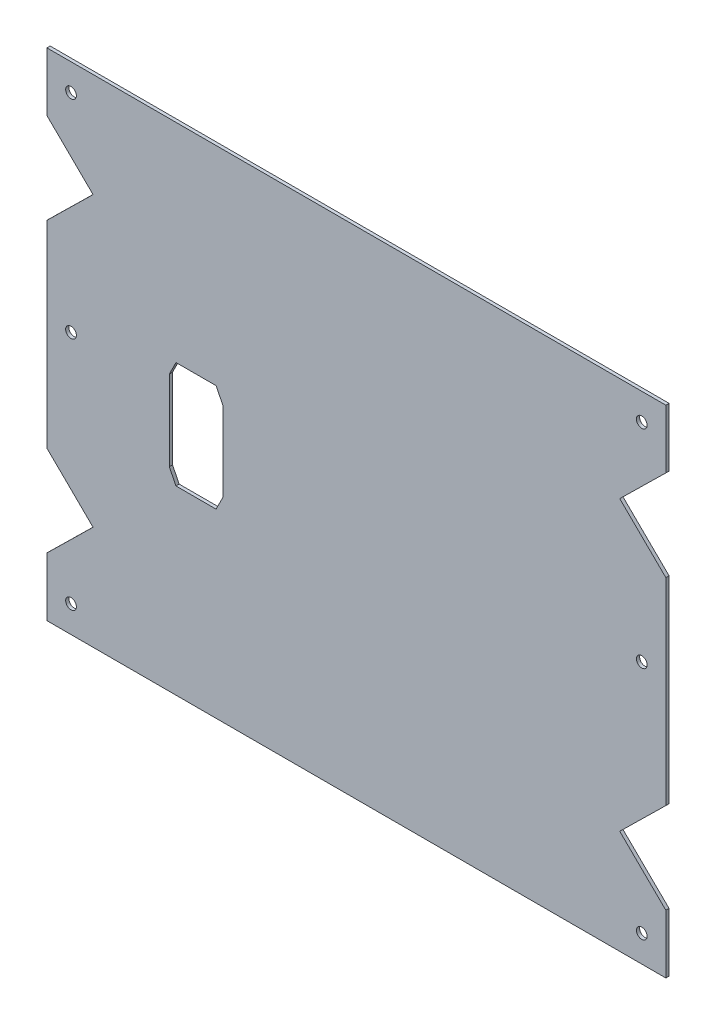
ISO-10303-21;
HEADER;
FILE_DESCRIPTION(('STEP AP214'),'2;1');
FILE_NAME('part.step','',(''),(''),'','','');
FILE_SCHEMA(('AUTOMOTIVE_DESIGN { 1 0 10303 214 1 1 1 1 }'));
ENDSEC;
DATA;
#1=APPLICATION_CONTEXT('core data for automotive mechanical design processes');
#2=APPLICATION_PROTOCOL_DEFINITION('international standard','automotive_design',2000,#1);
#3=PRODUCT_CONTEXT('',#1,'mechanical');
#4=PRODUCT('Part','Part','',(#3));
#5=PRODUCT_RELATED_PRODUCT_CATEGORY('part','',(#4));
#6=PRODUCT_DEFINITION_FORMATION('','',#4);
#7=PRODUCT_DEFINITION_CONTEXT('part definition',#1,'design');
#8=PRODUCT_DEFINITION('design','',#6,#7);
#9=PRODUCT_DEFINITION_SHAPE('','',#8);
#10=(LENGTH_UNIT() NAMED_UNIT(*) SI_UNIT(.MILLI.,.METRE.));
#11=(NAMED_UNIT(*) PLANE_ANGLE_UNIT() SI_UNIT($,.RADIAN.));
#12=(NAMED_UNIT(*) SI_UNIT($,.STERADIAN.) SOLID_ANGLE_UNIT());
#13=UNCERTAINTY_MEASURE_WITH_UNIT(LENGTH_MEASURE(1.E-05),#10,'distance_accuracy_value','');
#14=(GEOMETRIC_REPRESENTATION_CONTEXT(3) GLOBAL_UNCERTAINTY_ASSIGNED_CONTEXT((#13)) GLOBAL_UNIT_ASSIGNED_CONTEXT((#10,
#11,#12)) REPRESENTATION_CONTEXT('',''));
#15=CARTESIAN_POINT('',(0.,0.,0.));
#16=DIRECTION('',(0.,0.,1.));
#17=DIRECTION('',(1.,0.,0.));
#18=AXIS2_PLACEMENT_3D('',#15,#16,#17);
#19=CARTESIAN_POINT('',(0.,0.,-1.2));
#20=DIRECTION('',(0.,0.,1.));
#21=DIRECTION('',(1.,0.,0.));
#22=AXIS2_PLACEMENT_3D('',#19,#20,#21);
#23=PLANE('',#22);
#24=DIRECTION('',(0.71325044915418,0.700909264299852,0.));
#25=VECTOR('',#24,1.);
#26=CARTESIAN_POINT('',(-125.084094973147,27.7909727460474,-1.19999999999985));
#27=LINE('',#26,#25);
#28=CARTESIAN_POINT('',(-115.773982116284,36.9399951697851,-1.19999999999991));
#29=VERTEX_POINT('',#28);
#30=CARTESIAN_POINT('',(-98.5234627656782,53.8920333229499,-1.20000000000004));
#31=VERTEX_POINT('',#30);
#32=EDGE_CURVE('E723',#29,#31,#27,.T.);
#33=ORIENTED_EDGE('',*,*,#32,.T.);
#34=DIRECTION('',(-0.71325044915418,0.700909264299853,0.));
#35=VECTOR('',#34,1.);
#36=CARTESIAN_POINT('',(-125.084094973147,79.9930938998523,-1.19999999999968));
#37=LINE('',#36,#35);
#38=CARTESIAN_POINT('',(-115.773982116284,70.8440714761147,-1.19999999999981));
#39=VERTEX_POINT('',#38);
#40=EDGE_CURVE('E753',#31,#39,#37,.T.);
#41=ORIENTED_EDGE('',*,*,#40,.T.);
#42=DIRECTION('',(0.,1.,0.));
#43=VECTOR('',#42,1.);
#44=CARTESIAN_POINT('',(-115.773982116284,54.9669467026682,-1.1999999999999));
#45=LINE('',#44,#43);
#46=CARTESIAN_POINT('',(-115.773982116284,92.8050127238137,-1.19999999999968));
#47=VERTEX_POINT('',#46);
#48=EDGE_CURVE('E759',#47,#39,#45,.F.);
#49=ORIENTED_EDGE('',*,*,#48,.F.);
#50=DIRECTION('',(1.,0.,0.));
#51=VECTOR('',#50,1.);
#52=CARTESIAN_POINT('',(-115.773982116284,92.8050127238137,-1.19999999999968));
#53=LINE('',#52,#51);
#54=CARTESIAN_POINT('',(115.773982116284,92.8050127238136,-1.19999999999959));
#55=VERTEX_POINT('',#54);
#56=EDGE_CURVE('E778',#55,#47,#53,.F.);
#57=ORIENTED_EDGE('',*,*,#56,.F.);
#58=DIRECTION('',(0.,-1.,0.));
#59=VECTOR('',#58,1.);
#60=CARTESIAN_POINT('',(115.773982116284,92.8050127238136,-1.19999999999959));
#61=LINE('',#60,#59);
#62=CARTESIAN_POINT('',(115.773982116284,70.8440714761146,-1.19999999999981));
#63=VERTEX_POINT('',#62);
#64=EDGE_CURVE('E772',#63,#55,#61,.F.);
#65=ORIENTED_EDGE('',*,*,#64,.F.);
#66=DIRECTION('',(-0.713250449154182,-0.700909264299851,0.));
#67=VECTOR('',#66,1.);
#68=CARTESIAN_POINT('',(125.084094973147,79.9930938998522,-1.19999999999965));
#69=LINE('',#68,#67);
#70=CARTESIAN_POINT('',(98.5234627656781,53.8920333229499,-1.20000000000008));
#71=VERTEX_POINT('',#70);
#72=EDGE_CURVE('E751',#63,#71,#69,.T.);
#73=ORIENTED_EDGE('',*,*,#72,.T.);
#74=DIRECTION('',(0.713250449154181,-0.700909264299852,0.));
#75=VECTOR('',#74,1.);
#76=CARTESIAN_POINT('',(125.084094973147,27.7909727460474,-1.19999999999985));
#77=LINE('',#76,#75);
#78=CARTESIAN_POINT('',(115.773982116284,36.9399951697851,-1.19999999999991));
#79=VERTEX_POINT('',#78);
#80=EDGE_CURVE('E864',#71,#79,#77,.T.);
#81=ORIENTED_EDGE('',*,*,#80,.T.);
#82=DIRECTION('',(0.,-1.,0.));
#83=VECTOR('',#82,1.);
#84=CARTESIAN_POINT('',(115.773982116284,52.8171199432316,-1.19999999999991));
#85=LINE('',#84,#83);
#86=CARTESIAN_POINT('',(115.773982116284,-36.9399951697851,-1.1999999999999));
#87=VERTEX_POINT('',#86);
#88=EDGE_CURVE('E831',#87,#79,#85,.F.);
#89=ORIENTED_EDGE('',*,*,#88,.F.);
#90=DIRECTION('',(-0.71325044915418,-0.700909264299852,0.));
#91=VECTOR('',#90,1.);
#92=CARTESIAN_POINT('',(125.084094973147,-27.7909727460474,-1.19999999999984));
#93=LINE('',#92,#91);
#94=CARTESIAN_POINT('',(98.5234627656782,-53.8920333229499,-1.20000000000002));
#95=VERTEX_POINT('',#94);
#96=EDGE_CURVE('E862',#87,#95,#93,.T.);
#97=ORIENTED_EDGE('',*,*,#96,.T.);
#98=DIRECTION('',(0.71325044915418,-0.700909264299853,0.));
#99=VECTOR('',#98,1.);
#100=CARTESIAN_POINT('',(125.084094973147,-79.9930938998523,-1.19999999999968));
#101=LINE('',#100,#99);
#102=CARTESIAN_POINT('',(115.773982116284,-70.8440714761147,-1.19999999999981));
#103=VERTEX_POINT('',#102);
#104=EDGE_CURVE('E793',#95,#103,#101,.T.);
#105=ORIENTED_EDGE('',*,*,#104,.T.);
#106=DIRECTION('',(0.,-1.,0.));
#107=VECTOR('',#106,1.);
#108=CARTESIAN_POINT('',(115.773982116284,-54.9669467026682,-1.1999999999999));
#109=LINE('',#108,#107);
#110=CARTESIAN_POINT('',(115.773982116284,-92.8050127238137,-1.19999999999968));
#111=VERTEX_POINT('',#110);
#112=EDGE_CURVE('E804',#111,#103,#109,.F.);
#113=ORIENTED_EDGE('',*,*,#112,.F.);
#114=DIRECTION('',(-1.,0.,0.));
#115=VECTOR('',#114,1.);
#116=CARTESIAN_POINT('',(-98.9739821162841,-92.8050127238137,-1.19999999999972));
#117=LINE('',#116,#115);
#118=CARTESIAN_POINT('',(-115.773982116284,-92.8050127238137,-1.19999999999962));
#119=VERTEX_POINT('',#118);
#120=EDGE_CURVE('E819',#119,#111,#117,.F.);
#121=ORIENTED_EDGE('',*,*,#120,.F.);
#122=DIRECTION('',(0.,1.,0.));
#123=VECTOR('',#122,1.);
#124=CARTESIAN_POINT('',(-115.773982116284,-92.8050127238137,-1.19999999999962));
#125=LINE('',#124,#123);
#126=CARTESIAN_POINT('',(-115.773982116284,-70.8440714761147,-1.19999999999975));
#127=VERTEX_POINT('',#126);
#128=EDGE_CURVE('E814',#127,#119,#125,.F.);
#129=ORIENTED_EDGE('',*,*,#128,.F.);
#130=DIRECTION('',(0.71325044915418,0.700909264299853,0.));
#131=VECTOR('',#130,1.);
#132=CARTESIAN_POINT('',(-125.084094973147,-79.9930938998523,-1.19999999999962));
#133=LINE('',#132,#131);
#134=CARTESIAN_POINT('',(-98.5234627656781,-53.8920333229499,-1.19999999999997));
#135=VERTEX_POINT('',#134);
#136=EDGE_CURVE('E796',#127,#135,#133,.T.);
#137=ORIENTED_EDGE('',*,*,#136,.T.);
#138=DIRECTION('',(-0.71325044915418,0.700909264299852,0.));
#139=VECTOR('',#138,1.);
#140=CARTESIAN_POINT('',(-125.084094973147,-27.7909727460474,-1.19999999999987));
#141=LINE('',#140,#139);
#142=CARTESIAN_POINT('',(-115.773982116284,-36.9399951697851,-1.19999999999992));
#143=VERTEX_POINT('',#142);
#144=EDGE_CURVE('E728',#135,#143,#141,.T.);
#145=ORIENTED_EDGE('',*,*,#144,.T.);
#146=DIRECTION('',(0.,1.,0.));
#147=VECTOR('',#146,1.);
#148=CARTESIAN_POINT('',(-115.773982116284,-52.8171199432316,-1.19999999999992));
#149=LINE('',#148,#147);
#150=EDGE_CURVE('E790',#29,#143,#149,.F.);
#151=ORIENTED_EDGE('',*,*,#150,.F.);
#152=EDGE_LOOP('',(#33,#41,#49,#57,#65,#73,#81,#89,#97,#105,#113,#121,#129,#137,#145,#151));
#153=FACE_BOUND('',#152,.T.);
#154=DIRECTION('',(-0.447213595499958,-0.894427190999916,0.));
#155=VECTOR('',#154,1.);
#156=CARTESIAN_POINT('',(-70.,9.98321512742431,-1.2));
#157=LINE('',#156,#155);
#158=CARTESIAN_POINT('',(-67.5,14.9832151274243,-1.2));
#159=VERTEX_POINT('',#158);
#160=CARTESIAN_POINT('',(-70.,9.98321512742431,-1.2));
#161=VERTEX_POINT('',#160);
#162=EDGE_CURVE('E892',#159,#161,#157,.T.);
#163=ORIENTED_EDGE('',*,*,#162,.T.);
#164=DIRECTION('',(0.,-1.,0.));
#165=VECTOR('',#164,1.);
#166=CARTESIAN_POINT('',(-70.,-20.0167848725757,-1.2));
#167=LINE('',#166,#165);
#168=CARTESIAN_POINT('',(-70.,-20.0167848725757,-1.2));
#169=VERTEX_POINT('',#168);
#170=EDGE_CURVE('E872',#161,#169,#167,.T.);
#171=ORIENTED_EDGE('',*,*,#170,.T.);
#172=DIRECTION('',(0.447213595499958,-0.894427190999916,0.));
#173=VECTOR('',#172,1.);
#174=CARTESIAN_POINT('',(-67.5,-25.0167848725757,-1.2));
#175=LINE('',#174,#173);
#176=CARTESIAN_POINT('',(-67.5,-25.0167848725757,-1.2));
#177=VERTEX_POINT('',#176);
#178=EDGE_CURVE('E875',#169,#177,#175,.T.);
#179=ORIENTED_EDGE('',*,*,#178,.T.);
#180=DIRECTION('',(1.,0.,0.));
#181=VECTOR('',#180,1.);
#182=CARTESIAN_POINT('',(-52.5,-25.0167848725757,-1.2));
#183=LINE('',#182,#181);
#184=CARTESIAN_POINT('',(-52.5,-25.0167848725757,-1.2));
#185=VERTEX_POINT('',#184);
#186=EDGE_CURVE('E558',#177,#185,#183,.T.);
#187=ORIENTED_EDGE('',*,*,#186,.T.);
#188=DIRECTION('',(0.447213595499959,0.894427190999915,0.));
#189=VECTOR('',#188,1.);
#190=CARTESIAN_POINT('',(-50.,-20.0167848725757,-1.2));
#191=LINE('',#190,#189);
#192=CARTESIAN_POINT('',(-50.,-20.0167848725757,-1.2));
#193=VERTEX_POINT('',#192);
#194=EDGE_CURVE('E880',#185,#193,#191,.T.);
#195=ORIENTED_EDGE('',*,*,#194,.T.);
#196=DIRECTION('',(0.,1.,0.));
#197=VECTOR('',#196,1.);
#198=CARTESIAN_POINT('',(-50.,9.98321512742431,-1.2));
#199=LINE('',#198,#197);
#200=CARTESIAN_POINT('',(-50.,9.98321512742431,-1.2));
#201=VERTEX_POINT('',#200);
#202=EDGE_CURVE('E883',#193,#201,#199,.T.);
#203=ORIENTED_EDGE('',*,*,#202,.T.);
#204=DIRECTION('',(-0.447213595499958,0.894427190999916,0.));
#205=VECTOR('',#204,1.);
#206=CARTESIAN_POINT('',(-52.5,14.9832151274243,-1.2));
#207=LINE('',#206,#205);
#208=CARTESIAN_POINT('',(-52.5,14.9832151274243,-1.2));
#209=VERTEX_POINT('',#208);
#210=EDGE_CURVE('E886',#201,#209,#207,.T.);
#211=ORIENTED_EDGE('',*,*,#210,.T.);
#212=DIRECTION('',(-1.,0.,0.));
#213=VECTOR('',#212,1.);
#214=CARTESIAN_POINT('',(-67.5,14.9832151274243,-1.2));
#215=LINE('',#214,#213);
#216=EDGE_CURVE('E889',#209,#159,#215,.T.);
#217=ORIENTED_EDGE('',*,*,#216,.T.);
#218=EDGE_LOOP('',(#163,#171,#179,#187,#195,#203,#211,#217));
#219=FACE_BOUND('',#218,.T.);
#220=CARTESIAN_POINT('',(106.773982116284,5.12853310424553,-1.19999999999998));
#221=DIRECTION('',(0.,0.,-1.));
#222=DIRECTION('',(-1.,0.,0.));
#223=AXIS2_PLACEMENT_3D('',#220,#221,#222);
#224=CIRCLE('',#223,2.);
#225=CARTESIAN_POINT('',(104.773982116284,5.12853310424553,-1.19999999999999));
#226=VERTEX_POINT('',#225);
#227=EDGE_CURVE('E867',#226,#226,#224,.T.);
#228=ORIENTED_EDGE('',*,*,#227,.F.);
#229=EDGE_LOOP('',(#228));
#230=FACE_BOUND('',#229,.T.);
#231=CARTESIAN_POINT('',(-106.773982116284,5.12853310424474,-1.19999999999998));
#232=DIRECTION('',(0.,0.,-1.));
#233=DIRECTION('',(-1.,0.,0.));
#234=AXIS2_PLACEMENT_3D('',#231,#232,#233);
#235=CIRCLE('',#234,2.);
#236=CARTESIAN_POINT('',(-108.773982116284,5.12853310424474,-1.19999999999997));
#237=VERTEX_POINT('',#236);
#238=EDGE_CURVE('E842',#237,#237,#235,.T.);
#239=ORIENTED_EDGE('',*,*,#238,.F.);
#240=EDGE_LOOP('',(#239));
#241=FACE_BOUND('',#240,.T.);
#242=CARTESIAN_POINT('',(106.773982116285,-82.8050127238138,-1.1999999999998));
#243=DIRECTION('',(0.,0.,-1.));
#244=DIRECTION('',(-0.999847695156391,-0.0174524064372864,0.));
#245=AXIS2_PLACEMENT_3D('',#242,#243,#244);
#246=CIRCLE('',#245,2.);
#247=CARTESIAN_POINT('',(104.774286725972,-82.8399175366883,-1.19999999999981));
#248=VERTEX_POINT('',#247);
#249=EDGE_CURVE('E816',#248,#248,#246,.T.);
#250=ORIENTED_EDGE('',*,*,#249,.F.);
#251=EDGE_LOOP('',(#250));
#252=FACE_BOUND('',#251,.T.);
#253=CARTESIAN_POINT('',(-106.773982116284,-82.8050127238137,-1.19999999999974));
#254=DIRECTION('',(0.,0.,-1.));
#255=DIRECTION('',(-0.999847695156391,0.0174524064372864,0.));
#256=AXIS2_PLACEMENT_3D('',#253,#254,#255);
#257=CIRCLE('',#256,2.);
#258=CARTESIAN_POINT('',(-108.773677506597,-82.7701079109391,-1.19999999999972));
#259=VERTEX_POINT('',#258);
#260=EDGE_CURVE('E743',#259,#259,#257,.T.);
#261=ORIENTED_EDGE('',*,*,#260,.F.);
#262=EDGE_LOOP('',(#261));
#263=FACE_BOUND('',#262,.T.);
#264=CARTESIAN_POINT('',(106.773982116283,82.8050127238138,-1.19999999999974));
#265=DIRECTION('',(0.,0.,-1.));
#266=DIRECTION('',(0.999847695156391,-0.0174524064372899,0.));
#267=AXIS2_PLACEMENT_3D('',#264,#265,#266);
#268=CIRCLE('',#267,2.);
#269=CARTESIAN_POINT('',(108.773677506596,82.7701079109392,-1.19999999999972));
#270=VERTEX_POINT('',#269);
#271=EDGE_CURVE('E780',#270,#270,#268,.T.);
#272=ORIENTED_EDGE('',*,*,#271,.F.);
#273=EDGE_LOOP('',(#272));
#274=FACE_BOUND('',#273,.T.);
#275=CARTESIAN_POINT('',(-106.773982116284,82.8050127238137,-1.19999999999983));
#276=DIRECTION('',(0.,0.,-1.));
#277=DIRECTION('',(0.999847695156391,0.0174524064372864,0.));
#278=AXIS2_PLACEMENT_3D('',#275,#276,#277);
#279=CIRCLE('',#278,2.);
#280=CARTESIAN_POINT('',(-104.774286725971,82.8399175366883,-1.19999999999984));
#281=VERTEX_POINT('',#280);
#282=EDGE_CURVE('E740',#281,#281,#279,.T.);
#283=ORIENTED_EDGE('',*,*,#282,.F.);
#284=EDGE_LOOP('',(#283));
#285=FACE_BOUND('',#284,.T.);
#286=ADVANCED_FACE('F541',(#153,#219,#230,#241,#252,#263,#274,#285),#23,.F.);
#287=CARTESIAN_POINT('',(0.,0.,0.));
#288=DIRECTION('',(0.,0.,1.));
#289=DIRECTION('',(1.,0.,0.));
#290=AXIS2_PLACEMENT_3D('',#287,#288,#289);
#291=PLANE('',#290);
#292=DIRECTION('',(-0.71325044915418,0.700909264299853,0.));
#293=VECTOR('',#292,1.);
#294=CARTESIAN_POINT('',(-99.9739821162841,55.3174547188867,0.));
#295=LINE('',#294,#293);
#296=CARTESIAN_POINT('',(-98.5234627656782,53.8920333229499,0.));
#297=VERTEX_POINT('',#296);
#298=CARTESIAN_POINT('',(-115.773982116284,70.8440714761147,1.94289029309402E-13));
#299=VERTEX_POINT('',#298);
#300=EDGE_CURVE('E744',#297,#299,#295,.T.);
#301=ORIENTED_EDGE('',*,*,#300,.F.);
#302=DIRECTION('',(0.71325044915418,0.700909264299852,0.));
#303=VECTOR('',#302,1.);
#304=CARTESIAN_POINT('',(-175.666159857671,-21.9158839787141,4.44089209850063E-13));
#305=LINE('',#304,#303);
#306=CARTESIAN_POINT('',(-115.773982116284,36.9399951697851,0.));
#307=VERTEX_POINT('',#306);
#308=EDGE_CURVE('E829',#307,#297,#305,.T.);
#309=ORIENTED_EDGE('',*,*,#308,.F.);
#310=DIRECTION('',(0.,-1.,0.));
#311=VECTOR('',#310,1.);
#312=CARTESIAN_POINT('',(-115.773982116284,0.,0.));
#313=LINE('',#312,#311);
#314=CARTESIAN_POINT('',(-115.773982116284,-36.9399951697851,0.));
#315=VERTEX_POINT('',#314);
#316=EDGE_CURVE('E719',#307,#315,#313,.T.);
#317=ORIENTED_EDGE('',*,*,#316,.T.);
#318=DIRECTION('',(-0.71325044915418,0.700909264299852,0.));
#319=VECTOR('',#318,1.);
#320=CARTESIAN_POINT('',(-99.9739821162841,-52.4666119270131,0.));
#321=LINE('',#320,#319);
#322=CARTESIAN_POINT('',(-98.5234627656781,-53.8920333229499,0.));
#323=VERTEX_POINT('',#322);
#324=EDGE_CURVE('E715',#323,#315,#321,.T.);
#325=ORIENTED_EDGE('',*,*,#324,.F.);
#326=DIRECTION('',(0.71325044915418,0.700909264299853,0.));
#327=VECTOR('',#326,1.);
#328=CARTESIAN_POINT('',(-129.362490259407,-84.1974612381873,4.23272528138341E-13));
#329=LINE('',#328,#327);
#330=CARTESIAN_POINT('',(-115.773982116284,-70.8440714761147,2.56739074444567E-13));
#331=VERTEX_POINT('',#330);
#332=EDGE_CURVE('E703',#331,#323,#329,.T.);
#333=ORIENTED_EDGE('',*,*,#332,.F.);
#334=DIRECTION('',(0.,-1.,0.));
#335=VECTOR('',#334,1.);
#336=CARTESIAN_POINT('',(-115.773982116284,-51.8454959292279,1.31838984174237E-13));
#337=LINE('',#336,#335);
#338=CARTESIAN_POINT('',(-115.773982116284,-92.8050127238137,3.88578058618805E-13));
#339=VERTEX_POINT('',#338);
#340=EDGE_CURVE('E812',#331,#339,#337,.T.);
#341=ORIENTED_EDGE('',*,*,#340,.T.);
#342=DIRECTION('',(1.,0.,0.));
#343=VECTOR('',#342,1.);
#344=CARTESIAN_POINT('',(-152.744662462161,-92.8050127238137,6.52256026967279E-13));
#345=LINE('',#344,#343);
#346=CARTESIAN_POINT('',(115.773982116284,-92.8050127238137,3.2612801348364E-13));
#347=VERTEX_POINT('',#346);
#348=EDGE_CURVE('E810',#339,#347,#345,.T.);
#349=ORIENTED_EDGE('',*,*,#348,.T.);
#350=DIRECTION('',(0.,1.,0.));
#351=VECTOR('',#350,1.);
#352=CARTESIAN_POINT('',(115.773982116284,-51.8454959292279,0.));
#353=LINE('',#352,#351);
#354=CARTESIAN_POINT('',(115.773982116284,-70.8440714761147,1.94289029309402E-13));
#355=VERTEX_POINT('',#354);
#356=EDGE_CURVE('E798',#347,#355,#353,.T.);
#357=ORIENTED_EDGE('',*,*,#356,.T.);
#358=DIRECTION('',(0.71325044915418,-0.700909264299853,0.));
#359=VECTOR('',#358,1.);
#360=CARTESIAN_POINT('',(99.9739821162842,-55.3174547188867,0.));
#361=LINE('',#360,#359);
#362=CARTESIAN_POINT('',(98.5234627656782,-53.8920333229499,0.));
#363=VERTEX_POINT('',#362);
#364=EDGE_CURVE('E712',#363,#355,#361,.T.);
#365=ORIENTED_EDGE('',*,*,#364,.F.);
#366=DIRECTION('',(-0.71325044915418,-0.700909264299852,0.));
#367=VECTOR('',#366,1.);
#368=CARTESIAN_POINT('',(175.666159857671,21.9158839787142,4.57966997657877E-13));
#369=LINE('',#368,#367);
#370=CARTESIAN_POINT('',(115.773982116284,-36.9399951697851,0.));
#371=VERTEX_POINT('',#370);
#372=EDGE_CURVE('E847',#371,#363,#369,.T.);
#373=ORIENTED_EDGE('',*,*,#372,.F.);
#374=DIRECTION('',(0.,1.,0.));
#375=VECTOR('',#374,1.);
#376=CARTESIAN_POINT('',(115.773982116284,0.,0.));
#377=LINE('',#376,#375);
#378=CARTESIAN_POINT('',(115.773982116284,36.9399951697851,0.));
#379=VERTEX_POINT('',#378);
#380=EDGE_CURVE('E852',#371,#379,#377,.T.);
#381=ORIENTED_EDGE('',*,*,#380,.T.);
#382=DIRECTION('',(0.713250449154181,-0.700909264299852,0.));
#383=VECTOR('',#382,1.);
#384=CARTESIAN_POINT('',(99.9739821162841,52.4666119270131,0.));
#385=LINE('',#384,#383);
#386=CARTESIAN_POINT('',(98.5234627656781,53.8920333229499,0.));
#387=VERTEX_POINT('',#386);
#388=EDGE_CURVE('E860',#387,#379,#385,.T.);
#389=ORIENTED_EDGE('',*,*,#388,.F.);
#390=DIRECTION('',(-0.713250449154182,-0.700909264299851,0.));
#391=VECTOR('',#390,1.);
#392=CARTESIAN_POINT('',(129.362490259407,84.1974612381872,4.30211422042248E-13));
#393=LINE('',#392,#391);
#394=CARTESIAN_POINT('',(115.773982116284,70.8440714761146,2.0122792321331E-13));
#395=VERTEX_POINT('',#394);
#396=EDGE_CURVE('E746',#395,#387,#393,.T.);
#397=ORIENTED_EDGE('',*,*,#396,.F.);
#398=DIRECTION('',(0.,1.,0.));
#399=VECTOR('',#398,1.);
#400=CARTESIAN_POINT('',(115.773982116284,51.8454959292278,0.));
#401=LINE('',#400,#399);
#402=CARTESIAN_POINT('',(115.773982116284,92.8050127238136,4.16333634234434E-13));
#403=VERTEX_POINT('',#402);
#404=EDGE_CURVE('E767',#395,#403,#401,.T.);
#405=ORIENTED_EDGE('',*,*,#404,.T.);
#406=DIRECTION('',(-1.,0.,0.));
#407=VECTOR('',#406,1.);
#408=CARTESIAN_POINT('',(152.744662462161,92.8050127238135,6.73072708679001E-13));
#409=LINE('',#408,#407);
#410=CARTESIAN_POINT('',(-115.773982116284,92.8050127238137,3.2612801348364E-13));
#411=VERTEX_POINT('',#410);
#412=EDGE_CURVE('E765',#403,#411,#409,.T.);
#413=ORIENTED_EDGE('',*,*,#412,.T.);
#414=DIRECTION('',(0.,-1.,0.));
#415=VECTOR('',#414,1.);
#416=CARTESIAN_POINT('',(-115.773982116284,51.8454959292279,0.));
#417=LINE('',#416,#415);
#418=EDGE_CURVE('E756',#411,#299,#417,.T.);
#419=ORIENTED_EDGE('',*,*,#418,.T.);
#420=EDGE_LOOP('',(#301,#309,#317,#325,#333,#341,#349,#357,#365,#373,#381,#389,#397,#405,#413,#419));
#421=FACE_BOUND('',#420,.T.);
#422=DIRECTION('',(0.,-1.,0.));
#423=VECTOR('',#422,1.);
#424=CARTESIAN_POINT('',(-70.,-20.0167848725757,0.));
#425=LINE('',#424,#423);
#426=CARTESIAN_POINT('',(-70.,9.98321512742431,0.));
#427=VERTEX_POINT('',#426);
#428=CARTESIAN_POINT('',(-70.,-20.0167848725757,0.));
#429=VERTEX_POINT('',#428);
#430=EDGE_CURVE('E565',#427,#429,#425,.T.);
#431=ORIENTED_EDGE('',*,*,#430,.F.);
#432=DIRECTION('',(-0.447213595499958,-0.894427190999916,0.));
#433=VECTOR('',#432,1.);
#434=CARTESIAN_POINT('',(-70.,9.98321512742431,0.));
#435=LINE('',#434,#433);
#436=CARTESIAN_POINT('',(-67.5,14.9832151274243,0.));
#437=VERTEX_POINT('',#436);
#438=EDGE_CURVE('E876',#437,#427,#435,.T.);
#439=ORIENTED_EDGE('',*,*,#438,.F.);
#440=DIRECTION('',(-1.,0.,0.));
#441=VECTOR('',#440,1.);
#442=CARTESIAN_POINT('',(-67.5,14.9832151274243,0.));
#443=LINE('',#442,#441);
#444=CARTESIAN_POINT('',(-52.5,14.9832151274243,0.));
#445=VERTEX_POINT('',#444);
#446=EDGE_CURVE('E911',#445,#437,#443,.T.);
#447=ORIENTED_EDGE('',*,*,#446,.F.);
#448=DIRECTION('',(-0.447213595499958,0.894427190999916,0.));
#449=VECTOR('',#448,1.);
#450=CARTESIAN_POINT('',(-52.5,14.9832151274243,0.));
#451=LINE('',#450,#449);
#452=CARTESIAN_POINT('',(-50.,9.98321512742431,0.));
#453=VERTEX_POINT('',#452);
#454=EDGE_CURVE('E908',#453,#445,#451,.T.);
#455=ORIENTED_EDGE('',*,*,#454,.F.);
#456=DIRECTION('',(0.,1.,0.));
#457=VECTOR('',#456,1.);
#458=CARTESIAN_POINT('',(-50.,9.98321512742431,0.));
#459=LINE('',#458,#457);
#460=CARTESIAN_POINT('',(-50.,-20.0167848725757,0.));
#461=VERTEX_POINT('',#460);
#462=EDGE_CURVE('E905',#461,#453,#459,.T.);
#463=ORIENTED_EDGE('',*,*,#462,.F.);
#464=DIRECTION('',(0.447213595499959,0.894427190999915,0.));
#465=VECTOR('',#464,1.);
#466=CARTESIAN_POINT('',(-50.,-20.0167848725757,0.));
#467=LINE('',#466,#465);
#468=CARTESIAN_POINT('',(-52.5,-25.0167848725757,0.));
#469=VERTEX_POINT('',#468);
#470=EDGE_CURVE('E902',#469,#461,#467,.T.);
#471=ORIENTED_EDGE('',*,*,#470,.F.);
#472=DIRECTION('',(1.,0.,0.));
#473=VECTOR('',#472,1.);
#474=CARTESIAN_POINT('',(-52.5,-25.0167848725757,0.));
#475=LINE('',#474,#473);
#476=CARTESIAN_POINT('',(-67.5,-25.0167848725757,0.));
#477=VERTEX_POINT('',#476);
#478=EDGE_CURVE('E899',#477,#469,#475,.T.);
#479=ORIENTED_EDGE('',*,*,#478,.F.);
#480=DIRECTION('',(0.447213595499958,-0.894427190999916,0.));
#481=VECTOR('',#480,1.);
#482=CARTESIAN_POINT('',(-67.5,-25.0167848725757,0.));
#483=LINE('',#482,#481);
#484=EDGE_CURVE('E896',#429,#477,#483,.T.);
#485=ORIENTED_EDGE('',*,*,#484,.F.);
#486=EDGE_LOOP('',(#431,#439,#447,#455,#463,#471,#479,#485));
#487=FACE_BOUND('',#486,.T.);
#488=CARTESIAN_POINT('',(106.773982116284,5.12853310424554,2.4980018054066E-13));
#489=DIRECTION('',(0.,0.,-1.));
#490=DIRECTION('',(0.,-1.,0.));
#491=AXIS2_PLACEMENT_3D('',#488,#489,#490);
#492=CIRCLE('',#491,2.);
#493=CARTESIAN_POINT('',(106.773982116284,3.12853310424553,2.57833923754589E-13));
#494=VERTEX_POINT('',#493);
#495=EDGE_CURVE('E855',#494,#494,#492,.T.);
#496=ORIENTED_EDGE('',*,*,#495,.T.);
#497=EDGE_LOOP('',(#496));
#498=FACE_BOUND('',#497,.T.);
#499=CARTESIAN_POINT('',(-106.773982116284,5.12853310424473,1.94289029309402E-13));
#500=DIRECTION('',(0.,0.,1.));
#501=DIRECTION('',(0.,-1.,0.));
#502=AXIS2_PLACEMENT_3D('',#499,#500,#501);
#503=CIRCLE('',#502,2.);
#504=CARTESIAN_POINT('',(-106.773982116284,3.12853310424473,1.86255286095474E-13));
#505=VERTEX_POINT('',#504);
#506=EDGE_CURVE('E839',#505,#505,#503,.T.);
#507=ORIENTED_EDGE('',*,*,#506,.F.);
#508=EDGE_LOOP('',(#507));
#509=FACE_BOUND('',#508,.T.);
#510=CARTESIAN_POINT('',(106.773982116285,-82.8050127238138,6.38378239159465E-13));
#511=DIRECTION('',(0.,0.,-1.));
#512=DIRECTION('',(-0.999847695156391,-0.0174524064372864,0.));
#513=AXIS2_PLACEMENT_3D('',#510,#511,#512);
#514=CIRCLE('',#513,2.);
#515=CARTESIAN_POINT('',(104.774286725972,-82.8399175366883,6.39651092509963E-13));
#516=VERTEX_POINT('',#515);
#517=EDGE_CURVE('E801',#516,#516,#514,.T.);
#518=ORIENTED_EDGE('',*,*,#517,.T.);
#519=EDGE_LOOP('',(#518));
#520=FACE_BOUND('',#519,.T.);
#521=CARTESIAN_POINT('',(-106.773982116284,-82.8050127238137,2.42861286636753E-13));
#522=DIRECTION('',(0.,0.,1.));
#523=DIRECTION('',(0.999847695156391,-0.0174524064372864,0.));
#524=AXIS2_PLACEMENT_3D('',#521,#522,#523);
#525=CIRCLE('',#524,2.);
#526=CARTESIAN_POINT('',(-104.774286725971,-82.8399175366883,2.28066697471885E-13));
#527=VERTEX_POINT('',#526);
#528=EDGE_CURVE('E824',#527,#527,#525,.T.);
#529=ORIENTED_EDGE('',*,*,#528,.F.);
#530=EDGE_LOOP('',(#529));
#531=FACE_BOUND('',#530,.T.);
#532=CARTESIAN_POINT('',(-106.773982116284,82.8050127238137,5.41233724504764E-13));
#533=DIRECTION('',(0.,0.,1.));
#534=DIRECTION('',(-0.999847695156391,-0.0174524064372864,0.));
#535=AXIS2_PLACEMENT_3D('',#532,#533,#534);
#536=CIRCLE('',#535,2.);
#537=CARTESIAN_POINT('',(-108.773677506597,82.7701079109391,5.39960871154266E-13));
#538=VERTEX_POINT('',#537);
#539=EDGE_CURVE('E783',#538,#538,#536,.T.);
#540=ORIENTED_EDGE('',*,*,#539,.F.);
#541=EDGE_LOOP('',(#540));
#542=FACE_BOUND('',#541,.T.);
#543=CARTESIAN_POINT('',(106.773982116283,82.8050127238137,3.40005801291454E-13));
#544=DIRECTION('',(0.,0.,-1.));
#545=DIRECTION('',(0.999847695156391,-0.0174524064372899,0.));
#546=AXIS2_PLACEMENT_3D('',#543,#544,#545);
#547=CIRCLE('',#546,2.);
#548=CARTESIAN_POINT('',(108.773677506596,82.7701079109392,3.54679285073656E-13));
#549=VERTEX_POINT('',#548);
#550=EDGE_CURVE('E769',#549,#549,#547,.T.);
#551=ORIENTED_EDGE('',*,*,#550,.T.);
#552=EDGE_LOOP('',(#551));
#553=FACE_BOUND('',#552,.T.);
#554=ADVANCED_FACE('F543',(#421,#487,#498,#509,#520,#531,#542,#553),#291,.T.);
#555=CARTESIAN_POINT('',(-70.,-20.0167848725757,-1.2));
#556=DIRECTION('',(-1.,0.,0.));
#557=DIRECTION('',(0.,0.,1.));
#558=AXIS2_PLACEMENT_3D('',#555,#556,#557);
#559=PLANE('',#558);
#560=ORIENTED_EDGE('',*,*,#430,.T.);
#561=DIRECTION('',(0.,0.,1.));
#562=VECTOR('',#561,1.);
#563=CARTESIAN_POINT('',(-70.,-20.0167848725757,-1.2));
#564=LINE('',#563,#562);
#565=EDGE_CURVE('E545',#169,#429,#564,.T.);
#566=ORIENTED_EDGE('',*,*,#565,.F.);
#567=ORIENTED_EDGE('',*,*,#170,.F.);
#568=DIRECTION('',(0.,0.,1.));
#569=VECTOR('',#568,1.);
#570=CARTESIAN_POINT('',(-70.,9.98321512742431,-1.2));
#571=LINE('',#570,#569);
#572=EDGE_CURVE('E13',#161,#427,#571,.T.);
#573=ORIENTED_EDGE('',*,*,#572,.T.);
#574=EDGE_LOOP('',(#560,#566,#567,#573));
#575=FACE_BOUND('',#574,.T.);
#576=ADVANCED_FACE('F943',(#575),#559,.F.);
#577=CARTESIAN_POINT('',(-70.,9.98321512742431,-1.2));
#578=DIRECTION('',(-0.894427190999916,0.447213595499958,0.));
#579=DIRECTION('',(-0.447213595499958,-0.894427190999916,0.));
#580=AXIS2_PLACEMENT_3D('',#577,#578,#579);
#581=PLANE('',#580);
#582=ORIENTED_EDGE('',*,*,#438,.T.);
#583=ORIENTED_EDGE('',*,*,#572,.F.);
#584=ORIENTED_EDGE('',*,*,#162,.F.);
#585=DIRECTION('',(0.,0.,1.));
#586=VECTOR('',#585,1.);
#587=CARTESIAN_POINT('',(-67.5,14.9832151274243,-1.2));
#588=LINE('',#587,#586);
#589=EDGE_CURVE('E550',#159,#437,#588,.T.);
#590=ORIENTED_EDGE('',*,*,#589,.T.);
#591=EDGE_LOOP('',(#582,#583,#584,#590));
#592=FACE_BOUND('',#591,.T.);
#593=ADVANCED_FACE('F945',(#592),#581,.F.);
#594=CARTESIAN_POINT('',(-67.5,14.9832151274243,-1.2));
#595=DIRECTION('',(0.,1.,0.));
#596=DIRECTION('',(0.,0.,1.));
#597=AXIS2_PLACEMENT_3D('',#594,#595,#596);
#598=PLANE('',#597);
#599=ORIENTED_EDGE('',*,*,#446,.T.);
#600=ORIENTED_EDGE('',*,*,#589,.F.);
#601=ORIENTED_EDGE('',*,*,#216,.F.);
#602=DIRECTION('',(0.,0.,1.));
#603=VECTOR('',#602,1.);
#604=CARTESIAN_POINT('',(-52.5,14.9832151274243,-1.2));
#605=LINE('',#604,#603);
#606=EDGE_CURVE('E917',#209,#445,#605,.T.);
#607=ORIENTED_EDGE('',*,*,#606,.T.);
#608=EDGE_LOOP('',(#599,#600,#601,#607));
#609=FACE_BOUND('',#608,.T.);
#610=ADVANCED_FACE('F949',(#609),#598,.F.);
#611=CARTESIAN_POINT('',(-52.5,14.9832151274243,-1.2));
#612=DIRECTION('',(0.894427190999916,0.447213595499958,0.));
#613=DIRECTION('',(-0.447213595499958,0.894427190999916,0.));
#614=AXIS2_PLACEMENT_3D('',#611,#612,#613);
#615=PLANE('',#614);
#616=ORIENTED_EDGE('',*,*,#454,.T.);
#617=ORIENTED_EDGE('',*,*,#606,.F.);
#618=ORIENTED_EDGE('',*,*,#210,.F.);
#619=DIRECTION('',(0.,0.,1.));
#620=VECTOR('',#619,1.);
#621=CARTESIAN_POINT('',(-50.,9.98321512742431,-1.2));
#622=LINE('',#621,#620);
#623=EDGE_CURVE('E919',#201,#453,#622,.T.);
#624=ORIENTED_EDGE('',*,*,#623,.T.);
#625=EDGE_LOOP('',(#616,#617,#618,#624));
#626=FACE_BOUND('',#625,.T.);
#627=ADVANCED_FACE('F953',(#626),#615,.F.);
#628=CARTESIAN_POINT('',(-50.,9.98321512742431,-1.2));
#629=DIRECTION('',(1.,0.,0.));
#630=DIRECTION('',(0.,0.,-1.));
#631=AXIS2_PLACEMENT_3D('',#628,#629,#630);
#632=PLANE('',#631);
#633=ORIENTED_EDGE('',*,*,#462,.T.);
#634=ORIENTED_EDGE('',*,*,#623,.F.);
#635=ORIENTED_EDGE('',*,*,#202,.F.);
#636=DIRECTION('',(0.,0.,1.));
#637=VECTOR('',#636,1.);
#638=CARTESIAN_POINT('',(-50.,-20.0167848725757,-1.2));
#639=LINE('',#638,#637);
#640=EDGE_CURVE('E921',#193,#461,#639,.T.);
#641=ORIENTED_EDGE('',*,*,#640,.T.);
#642=EDGE_LOOP('',(#633,#634,#635,#641));
#643=FACE_BOUND('',#642,.T.);
#644=ADVANCED_FACE('F955',(#643),#632,.F.);
#645=CARTESIAN_POINT('',(-50.,-20.0167848725757,-1.2));
#646=DIRECTION('',(0.894427190999915,-0.447213595499959,0.));
#647=DIRECTION('',(0.447213595499959,0.894427190999915,0.));
#648=AXIS2_PLACEMENT_3D('',#645,#646,#647);
#649=PLANE('',#648);
#650=ORIENTED_EDGE('',*,*,#470,.T.);
#651=ORIENTED_EDGE('',*,*,#640,.F.);
#652=ORIENTED_EDGE('',*,*,#194,.F.);
#653=DIRECTION('',(0.,0.,1.));
#654=VECTOR('',#653,1.);
#655=CARTESIAN_POINT('',(-52.5,-25.0167848725757,-1.2));
#656=LINE('',#655,#654);
#657=EDGE_CURVE('E923',#185,#469,#656,.T.);
#658=ORIENTED_EDGE('',*,*,#657,.T.);
#659=EDGE_LOOP('',(#650,#651,#652,#658));
#660=FACE_BOUND('',#659,.T.);
#661=ADVANCED_FACE('F938',(#660),#649,.F.);
#662=CARTESIAN_POINT('',(-52.5,-25.0167848725757,-1.2));
#663=DIRECTION('',(0.,-1.,0.));
#664=DIRECTION('',(0.,0.,-1.));
#665=AXIS2_PLACEMENT_3D('',#662,#663,#664);
#666=PLANE('',#665);
#667=ORIENTED_EDGE('',*,*,#478,.T.);
#668=ORIENTED_EDGE('',*,*,#657,.F.);
#669=ORIENTED_EDGE('',*,*,#186,.F.);
#670=DIRECTION('',(0.,0.,1.));
#671=VECTOR('',#670,1.);
#672=CARTESIAN_POINT('',(-67.5,-25.0167848725757,-1.2));
#673=LINE('',#672,#671);
#674=EDGE_CURVE('E924',#177,#477,#673,.T.);
#675=ORIENTED_EDGE('',*,*,#674,.T.);
#676=EDGE_LOOP('',(#667,#668,#669,#675));
#677=FACE_BOUND('',#676,.T.);
#678=ADVANCED_FACE('F935',(#677),#666,.F.);
#679=CARTESIAN_POINT('',(-67.5,-25.0167848725757,-1.2));
#680=DIRECTION('',(-0.894427190999916,-0.447213595499958,0.));
#681=DIRECTION('',(0.447213595499958,-0.894427190999916,0.));
#682=AXIS2_PLACEMENT_3D('',#679,#680,#681);
#683=PLANE('',#682);
#684=ORIENTED_EDGE('',*,*,#484,.T.);
#685=ORIENTED_EDGE('',*,*,#674,.F.);
#686=ORIENTED_EDGE('',*,*,#178,.F.);
#687=ORIENTED_EDGE('',*,*,#565,.T.);
#688=EDGE_LOOP('',(#684,#685,#686,#687));
#689=FACE_BOUND('',#688,.T.);
#690=ADVANCED_FACE('F928',(#689),#683,.F.);
#691=CARTESIAN_POINT('',(115.773982116284,52.8171199432316,0.));
#692=DIRECTION('',(-1.,0.,0.));
#693=DIRECTION('',(0.,0.,1.));
#694=AXIS2_PLACEMENT_3D('',#691,#692,#693);
#695=PLANE('',#694);
#696=DIRECTION('',(0.,0.,-1.));
#697=VECTOR('',#696,1.);
#698=CARTESIAN_POINT('',(115.773982116284,36.9399951697851,0.));
#699=LINE('',#698,#697);
#700=EDGE_CURVE('E858',#379,#79,#699,.T.);
#701=ORIENTED_EDGE('',*,*,#700,.F.);
#702=ORIENTED_EDGE('',*,*,#380,.F.);
#703=DIRECTION('',(0.,0.,1.));
#704=VECTOR('',#703,1.);
#705=CARTESIAN_POINT('',(115.773982116284,-36.9399951697851,0.));
#706=LINE('',#705,#704);
#707=EDGE_CURVE('E849',#87,#371,#706,.T.);
#708=ORIENTED_EDGE('',*,*,#707,.F.);
#709=ORIENTED_EDGE('',*,*,#88,.T.);
#710=EDGE_LOOP('',(#701,#702,#708,#709));
#711=FACE_BOUND('',#710,.T.);
#712=ADVANCED_FACE('F974',(#711),#695,.F.);
#713=CARTESIAN_POINT('',(106.773982116284,5.12853310424554,2.4980018054066E-13));
#714=DIRECTION('',(0.,0.,-1.));
#715=DIRECTION('',(0.,-1.,0.));
#716=AXIS2_PLACEMENT_3D('',#713,#714,#715);
#717=CYLINDRICAL_SURFACE('',#716,2.);
#718=ORIENTED_EDGE('',*,*,#227,.T.);
#719=EDGE_LOOP('',(#718));
#720=FACE_BOUND('',#719,.T.);
#721=ORIENTED_EDGE('',*,*,#495,.F.);
#722=EDGE_LOOP('',(#721));
#723=FACE_BOUND('',#722,.T.);
#724=ADVANCED_FACE('F992',(#720,#723),#717,.F.);
#725=CARTESIAN_POINT('',(99.9739821162841,52.4666119270131,0.));
#726=DIRECTION('',(0.700909264299852,0.713250449154181,0.));
#727=DIRECTION('',(-0.713250449154181,0.700909264299852,0.));
#728=AXIS2_PLACEMENT_3D('',#725,#726,#727);
#729=PLANE('',#728);
#730=ORIENTED_EDGE('',*,*,#80,.F.);
#731=DIRECTION('',(0.,0.,-1.));
#732=VECTOR('',#731,1.);
#733=CARTESIAN_POINT('',(98.5234627656781,53.8920333229499,0.));
#734=LINE('',#733,#732);
#735=EDGE_CURVE('E737',#387,#71,#734,.T.);
#736=ORIENTED_EDGE('',*,*,#735,.F.);
#737=ORIENTED_EDGE('',*,*,#388,.T.);
#738=ORIENTED_EDGE('',*,*,#700,.T.);
#739=EDGE_LOOP('',(#730,#736,#737,#738));
#740=FACE_BOUND('',#739,.T.);
#741=ADVANCED_FACE('F1001',(#740),#729,.T.);
#742=CARTESIAN_POINT('',(175.666159857671,21.9158839787142,4.57966997657877E-13));
#743=DIRECTION('',(0.700909264299852,-0.71325044915418,0.));
#744=DIRECTION('',(0.71325044915418,0.700909264299852,0.));
#745=AXIS2_PLACEMENT_3D('',#742,#743,#744);
#746=PLANE('',#745);
#747=ORIENTED_EDGE('',*,*,#96,.F.);
#748=ORIENTED_EDGE('',*,*,#707,.T.);
#749=ORIENTED_EDGE('',*,*,#372,.T.);
#750=DIRECTION('',(0.,0.,-1.));
#751=VECTOR('',#750,1.);
#752=CARTESIAN_POINT('',(98.5234627656782,-53.8920333229499,0.));
#753=LINE('',#752,#751);
#754=EDGE_CURVE('E732',#363,#95,#753,.T.);
#755=ORIENTED_EDGE('',*,*,#754,.T.);
#756=EDGE_LOOP('',(#747,#748,#749,#755));
#757=FACE_BOUND('',#756,.T.);
#758=ADVANCED_FACE('F1010',(#757),#746,.T.);
#759=CARTESIAN_POINT('',(-115.773982116284,-52.8171199432316,0.));
#760=DIRECTION('',(1.,0.,0.));
#761=DIRECTION('',(0.,0.,-1.));
#762=AXIS2_PLACEMENT_3D('',#759,#760,#761);
#763=PLANE('',#762);
#764=DIRECTION('',(0.,0.,-1.));
#765=VECTOR('',#764,1.);
#766=CARTESIAN_POINT('',(-115.773982116284,-36.9399951697851,0.));
#767=LINE('',#766,#765);
#768=EDGE_CURVE('E722',#315,#143,#767,.T.);
#769=ORIENTED_EDGE('',*,*,#768,.F.);
#770=ORIENTED_EDGE('',*,*,#316,.F.);
#771=DIRECTION('',(0.,0.,1.));
#772=VECTOR('',#771,1.);
#773=CARTESIAN_POINT('',(-115.773982116284,36.9399951697851,0.));
#774=LINE('',#773,#772);
#775=EDGE_CURVE('E832',#29,#307,#774,.T.);
#776=ORIENTED_EDGE('',*,*,#775,.F.);
#777=ORIENTED_EDGE('',*,*,#150,.T.);
#778=EDGE_LOOP('',(#769,#770,#776,#777));
#779=FACE_BOUND('',#778,.T.);
#780=ADVANCED_FACE('F1019',(#779),#763,.F.);
#781=CARTESIAN_POINT('',(-106.773982116285,5.12853310424554,-200.));
#782=DIRECTION('',(0.,0.,1.));
#783=DIRECTION('',(0.,-1.,0.));
#784=AXIS2_PLACEMENT_3D('',#781,#782,#783);
#785=CYLINDRICAL_SURFACE('',#784,2.);
#786=ORIENTED_EDGE('',*,*,#238,.T.);
#787=EDGE_LOOP('',(#786));
#788=FACE_BOUND('',#787,.T.);
#789=ORIENTED_EDGE('',*,*,#506,.T.);
#790=EDGE_LOOP('',(#789));
#791=FACE_BOUND('',#790,.T.);
#792=ADVANCED_FACE('F1028',(#788,#791),#785,.F.);
#793=CARTESIAN_POINT('',(-99.9739821162841,-52.4666119270131,0.));
#794=DIRECTION('',(-0.700909264299852,-0.71325044915418,0.));
#795=DIRECTION('',(-0.71325044915418,0.700909264299852,0.));
#796=AXIS2_PLACEMENT_3D('',#793,#794,#795);
#797=PLANE('',#796);
#798=ORIENTED_EDGE('',*,*,#144,.F.);
#799=DIRECTION('',(0.,0.,-1.));
#800=VECTOR('',#799,1.);
#801=CARTESIAN_POINT('',(-98.5234627656781,-53.8920333229499,0.));
#802=LINE('',#801,#800);
#803=EDGE_CURVE('E708',#323,#135,#802,.T.);
#804=ORIENTED_EDGE('',*,*,#803,.F.);
#805=ORIENTED_EDGE('',*,*,#324,.T.);
#806=ORIENTED_EDGE('',*,*,#768,.T.);
#807=EDGE_LOOP('',(#798,#804,#805,#806));
#808=FACE_BOUND('',#807,.T.);
#809=ADVANCED_FACE('F726',(#808),#797,.T.);
#810=CARTESIAN_POINT('',(-175.666159857671,-21.9158839787141,4.44089209850063E-13));
#811=DIRECTION('',(-0.700909264299852,0.71325044915418,0.));
#812=DIRECTION('',(0.71325044915418,0.700909264299852,0.));
#813=AXIS2_PLACEMENT_3D('',#810,#811,#812);
#814=PLANE('',#813);
#815=ORIENTED_EDGE('',*,*,#32,.F.);
#816=ORIENTED_EDGE('',*,*,#775,.T.);
#817=ORIENTED_EDGE('',*,*,#308,.T.);
#818=DIRECTION('',(0.,0.,-1.));
#819=VECTOR('',#818,1.);
#820=CARTESIAN_POINT('',(-98.5234627656782,53.8920333229499,0.));
#821=LINE('',#820,#819);
#822=EDGE_CURVE('E729',#297,#31,#821,.T.);
#823=ORIENTED_EDGE('',*,*,#822,.T.);
#824=EDGE_LOOP('',(#815,#816,#817,#823));
#825=FACE_BOUND('',#824,.T.);
#826=ADVANCED_FACE('F1045',(#825),#814,.T.);
#827=CARTESIAN_POINT('',(-106.773982116286,-82.805012723815,-200.));
#828=DIRECTION('',(0.,0.,1.));
#829=DIRECTION('',(0.999847695156391,-0.0174524064372864,0.));
#830=AXIS2_PLACEMENT_3D('',#827,#828,#829);
#831=CYLINDRICAL_SURFACE('',#830,2.);
#832=ORIENTED_EDGE('',*,*,#260,.T.);
#833=EDGE_LOOP('',(#832));
#834=FACE_BOUND('',#833,.T.);
#835=ORIENTED_EDGE('',*,*,#528,.T.);
#836=EDGE_LOOP('',(#835));
#837=FACE_BOUND('',#836,.T.);
#838=ADVANCED_FACE('F1053',(#834,#837),#831,.F.);
#839=CARTESIAN_POINT('',(-98.9739821162841,-92.8050127238137,2.91433543964104E-13));
#840=DIRECTION('',(0.,1.,0.));
#841=DIRECTION('',(1.,0.,0.));
#842=AXIS2_PLACEMENT_3D('',#839,#840,#841);
#843=PLANE('',#842);
#844=ORIENTED_EDGE('',*,*,#120,.T.);
#845=DIRECTION('',(0.,0.,-1.));
#846=VECTOR('',#845,1.);
#847=CARTESIAN_POINT('',(115.773982116284,-92.8050127238137,3.2612801348364E-13));
#848=LINE('',#847,#846);
#849=EDGE_CURVE('E807',#347,#111,#848,.T.);
#850=ORIENTED_EDGE('',*,*,#849,.F.);
#851=ORIENTED_EDGE('',*,*,#348,.F.);
#852=DIRECTION('',(0.,0.,-1.));
#853=VECTOR('',#852,1.);
#854=CARTESIAN_POINT('',(-115.773982116284,-92.8050127238137,3.88578058618805E-13));
#855=LINE('',#854,#853);
#856=EDGE_CURVE('E821',#339,#119,#855,.T.);
#857=ORIENTED_EDGE('',*,*,#856,.T.);
#858=EDGE_LOOP('',(#844,#850,#851,#857));
#859=FACE_BOUND('',#858,.T.);
#860=ADVANCED_FACE('F1062',(#859),#843,.F.);
#861=CARTESIAN_POINT('',(106.773982116285,-82.8050127238138,6.38378239159465E-13));
#862=DIRECTION('',(0.,0.,-1.));
#863=DIRECTION('',(-0.999847695156391,-0.0174524064372864,0.));
#864=AXIS2_PLACEMENT_3D('',#861,#862,#863);
#865=CYLINDRICAL_SURFACE('',#864,2.);
#866=ORIENTED_EDGE('',*,*,#249,.T.);
#867=EDGE_LOOP('',(#866));
#868=FACE_BOUND('',#867,.T.);
#869=ORIENTED_EDGE('',*,*,#517,.F.);
#870=EDGE_LOOP('',(#869));
#871=FACE_BOUND('',#870,.T.);
#872=ADVANCED_FACE('F1072',(#868,#871),#865,.F.);
#873=CARTESIAN_POINT('',(-115.773982116284,-92.8050127238137,3.88578058618805E-13));
#874=DIRECTION('',(1.,0.,0.));
#875=DIRECTION('',(0.,-1.,0.));
#876=AXIS2_PLACEMENT_3D('',#873,#874,#875);
#877=PLANE('',#876);
#878=DIRECTION('',(0.,0.,1.));
#879=VECTOR('',#878,1.);
#880=CARTESIAN_POINT('',(-115.773982116284,-70.8440714761147,2.42861286636753E-13));
#881=LINE('',#880,#879);
#882=EDGE_CURVE('E709',#127,#331,#881,.T.);
#883=ORIENTED_EDGE('',*,*,#882,.F.);
#884=ORIENTED_EDGE('',*,*,#128,.T.);
#885=ORIENTED_EDGE('',*,*,#856,.F.);
#886=ORIENTED_EDGE('',*,*,#340,.F.);
#887=EDGE_LOOP('',(#883,#884,#885,#886));
#888=FACE_BOUND('',#887,.T.);
#889=ADVANCED_FACE('F1082',(#888),#877,.F.);
#890=CARTESIAN_POINT('',(115.773982116284,-54.9669467026682,0.));
#891=DIRECTION('',(-1.,0.,0.));
#892=DIRECTION('',(0.,-1.,0.));
#893=AXIS2_PLACEMENT_3D('',#890,#891,#892);
#894=PLANE('',#893);
#895=DIRECTION('',(0.,0.,-1.));
#896=VECTOR('',#895,1.);
#897=CARTESIAN_POINT('',(115.773982116284,-70.8440714761147,1.94289029309402E-13));
#898=LINE('',#897,#896);
#899=EDGE_CURVE('E788',#355,#103,#898,.T.);
#900=ORIENTED_EDGE('',*,*,#899,.F.);
#901=ORIENTED_EDGE('',*,*,#356,.F.);
#902=ORIENTED_EDGE('',*,*,#849,.T.);
#903=ORIENTED_EDGE('',*,*,#112,.T.);
#904=EDGE_LOOP('',(#900,#901,#902,#903));
#905=FACE_BOUND('',#904,.T.);
#906=ADVANCED_FACE('F1091',(#905),#894,.F.);
#907=CARTESIAN_POINT('',(-129.362490259407,-84.1974612381873,4.23272528138341E-13));
#908=DIRECTION('',(-0.700909264299853,0.71325044915418,0.));
#909=DIRECTION('',(0.71325044915418,0.700909264299853,0.));
#910=AXIS2_PLACEMENT_3D('',#907,#908,#909);
#911=PLANE('',#910);
#912=ORIENTED_EDGE('',*,*,#136,.F.);
#913=ORIENTED_EDGE('',*,*,#882,.T.);
#914=ORIENTED_EDGE('',*,*,#332,.T.);
#915=ORIENTED_EDGE('',*,*,#803,.T.);
#916=EDGE_LOOP('',(#912,#913,#914,#915));
#917=FACE_BOUND('',#916,.T.);
#918=ADVANCED_FACE('F706',(#917),#911,.T.);
#919=CARTESIAN_POINT('',(99.9739821162842,-55.3174547188867,0.));
#920=DIRECTION('',(0.700909264299853,0.71325044915418,0.));
#921=DIRECTION('',(-0.71325044915418,0.700909264299853,0.));
#922=AXIS2_PLACEMENT_3D('',#919,#920,#921);
#923=PLANE('',#922);
#924=ORIENTED_EDGE('',*,*,#104,.F.);
#925=ORIENTED_EDGE('',*,*,#754,.F.);
#926=ORIENTED_EDGE('',*,*,#364,.T.);
#927=ORIENTED_EDGE('',*,*,#899,.T.);
#928=EDGE_LOOP('',(#924,#925,#926,#927));
#929=FACE_BOUND('',#928,.T.);
#930=ADVANCED_FACE('F1108',(#929),#923,.T.);
#931=CARTESIAN_POINT('',(-106.773982116284,82.8050127238151,-200.));
#932=DIRECTION('',(0.,0.,1.));
#933=DIRECTION('',(-0.999847695156391,-0.0174524064372864,0.));
#934=AXIS2_PLACEMENT_3D('',#931,#932,#933);
#935=CYLINDRICAL_SURFACE('',#934,2.);
#936=ORIENTED_EDGE('',*,*,#282,.T.);
#937=EDGE_LOOP('',(#936));
#938=FACE_BOUND('',#937,.T.);
#939=ORIENTED_EDGE('',*,*,#539,.T.);
#940=EDGE_LOOP('',(#939));
#941=FACE_BOUND('',#940,.T.);
#942=ADVANCED_FACE('F1116',(#938,#941),#935,.F.);
#943=CARTESIAN_POINT('',(106.773982116283,82.8050127238137,3.40005801291454E-13));
#944=DIRECTION('',(0.,0.,-1.));
#945=DIRECTION('',(0.999847695156391,-0.0174524064372899,0.));
#946=AXIS2_PLACEMENT_3D('',#943,#944,#945);
#947=CYLINDRICAL_SURFACE('',#946,2.);
#948=ORIENTED_EDGE('',*,*,#271,.T.);
#949=EDGE_LOOP('',(#948));
#950=FACE_BOUND('',#949,.T.);
#951=ORIENTED_EDGE('',*,*,#550,.F.);
#952=EDGE_LOOP('',(#951));
#953=FACE_BOUND('',#952,.T.);
#954=ADVANCED_FACE('F1125',(#950,#953),#947,.F.);
#955=CARTESIAN_POINT('',(-115.773982116284,92.8050127238137,3.2612801348364E-13));
#956=DIRECTION('',(0.,-1.,0.));
#957=DIRECTION('',(-1.,0.,0.));
#958=AXIS2_PLACEMENT_3D('',#955,#956,#957);
#959=PLANE('',#958);
#960=DIRECTION('',(0.,0.,-1.));
#961=VECTOR('',#960,1.);
#962=CARTESIAN_POINT('',(-115.773982116284,92.8050127238137,3.2612801348364E-13));
#963=LINE('',#962,#961);
#964=EDGE_CURVE('E762',#411,#47,#963,.T.);
#965=ORIENTED_EDGE('',*,*,#964,.F.);
#966=ORIENTED_EDGE('',*,*,#412,.F.);
#967=DIRECTION('',(0.,0.,-1.));
#968=VECTOR('',#967,1.);
#969=CARTESIAN_POINT('',(115.773982116284,92.8050127238136,4.16333634234434E-13));
#970=LINE('',#969,#968);
#971=EDGE_CURVE('E775',#403,#55,#970,.T.);
#972=ORIENTED_EDGE('',*,*,#971,.T.);
#973=ORIENTED_EDGE('',*,*,#56,.T.);
#974=EDGE_LOOP('',(#965,#966,#972,#973));
#975=FACE_BOUND('',#974,.T.);
#976=ADVANCED_FACE('F1134',(#975),#959,.F.);
#977=CARTESIAN_POINT('',(115.773982116284,92.8050127238136,4.16333634234434E-13));
#978=DIRECTION('',(-1.,0.,0.));
#979=DIRECTION('',(0.,-1.,0.));
#980=AXIS2_PLACEMENT_3D('',#977,#978,#979);
#981=PLANE('',#980);
#982=DIRECTION('',(0.,0.,1.));
#983=VECTOR('',#982,1.);
#984=CARTESIAN_POINT('',(115.773982116284,70.8440714761146,1.87350135405495E-13));
#985=LINE('',#984,#983);
#986=EDGE_CURVE('E748',#63,#395,#985,.T.);
#987=ORIENTED_EDGE('',*,*,#986,.F.);
#988=ORIENTED_EDGE('',*,*,#64,.T.);
#989=ORIENTED_EDGE('',*,*,#971,.F.);
#990=ORIENTED_EDGE('',*,*,#404,.F.);
#991=EDGE_LOOP('',(#987,#988,#989,#990));
#992=FACE_BOUND('',#991,.T.);
#993=ADVANCED_FACE('F1144',(#992),#981,.F.);
#994=CARTESIAN_POINT('',(-115.773982116284,54.9669467026682,0.));
#995=DIRECTION('',(1.,0.,0.));
#996=DIRECTION('',(0.,-1.,0.));
#997=AXIS2_PLACEMENT_3D('',#994,#995,#996);
#998=PLANE('',#997);
#999=DIRECTION('',(0.,0.,-1.));
#1000=VECTOR('',#999,1.);
#1001=CARTESIAN_POINT('',(-115.773982116284,70.8440714761147,1.94289029309402E-13));
#1002=LINE('',#1001,#1000);
#1003=EDGE_CURVE('E741',#299,#39,#1002,.T.);
#1004=ORIENTED_EDGE('',*,*,#1003,.F.);
#1005=ORIENTED_EDGE('',*,*,#418,.F.);
#1006=ORIENTED_EDGE('',*,*,#964,.T.);
#1007=ORIENTED_EDGE('',*,*,#48,.T.);
#1008=EDGE_LOOP('',(#1004,#1005,#1006,#1007));
#1009=FACE_BOUND('',#1008,.T.);
#1010=ADVANCED_FACE('F1153',(#1009),#998,.F.);
#1011=CARTESIAN_POINT('',(129.362490259407,84.1974612381872,4.30211422042248E-13));
#1012=DIRECTION('',(0.700909264299851,-0.713250449154182,0.));
#1013=DIRECTION('',(0.713250449154182,0.700909264299851,0.));
#1014=AXIS2_PLACEMENT_3D('',#1011,#1012,#1013);
#1015=PLANE('',#1014);
#1016=ORIENTED_EDGE('',*,*,#72,.F.);
#1017=ORIENTED_EDGE('',*,*,#986,.T.);
#1018=ORIENTED_EDGE('',*,*,#396,.T.);
#1019=ORIENTED_EDGE('',*,*,#735,.T.);
#1020=EDGE_LOOP('',(#1016,#1017,#1018,#1019));
#1021=FACE_BOUND('',#1020,.T.);
#1022=ADVANCED_FACE('F1162',(#1021),#1015,.T.);
#1023=CARTESIAN_POINT('',(-99.9739821162841,55.3174547188867,0.));
#1024=DIRECTION('',(-0.700909264299853,-0.71325044915418,0.));
#1025=DIRECTION('',(-0.71325044915418,0.700909264299853,0.));
#1026=AXIS2_PLACEMENT_3D('',#1023,#1024,#1025);
#1027=PLANE('',#1026);
#1028=ORIENTED_EDGE('',*,*,#40,.F.);
#1029=ORIENTED_EDGE('',*,*,#822,.F.);
#1030=ORIENTED_EDGE('',*,*,#300,.T.);
#1031=ORIENTED_EDGE('',*,*,#1003,.T.);
#1032=EDGE_LOOP('',(#1028,#1029,#1030,#1031));
#1033=FACE_BOUND('',#1032,.T.);
#1034=ADVANCED_FACE('F1171',(#1033),#1027,.T.);
#1035=CLOSED_SHELL('',(#286,#554,#576,#593,#610,#627,#644,#661,#678,#690,#712,#724,#741,#758,
#780,#792,#809,#826,#838,#860,#872,#889,#906,#918,#930,#942,#954,#976,#993,#1010,#1022,#1034));
#1036=MANIFOLD_SOLID_BREP('B2',#1035);
#1037=ADVANCED_BREP_SHAPE_REPRESENTATION('',(#18,#1036),#14);
#1038=SHAPE_DEFINITION_REPRESENTATION(#9,#1037);
ENDSEC;
END-ISO-10303-21;
